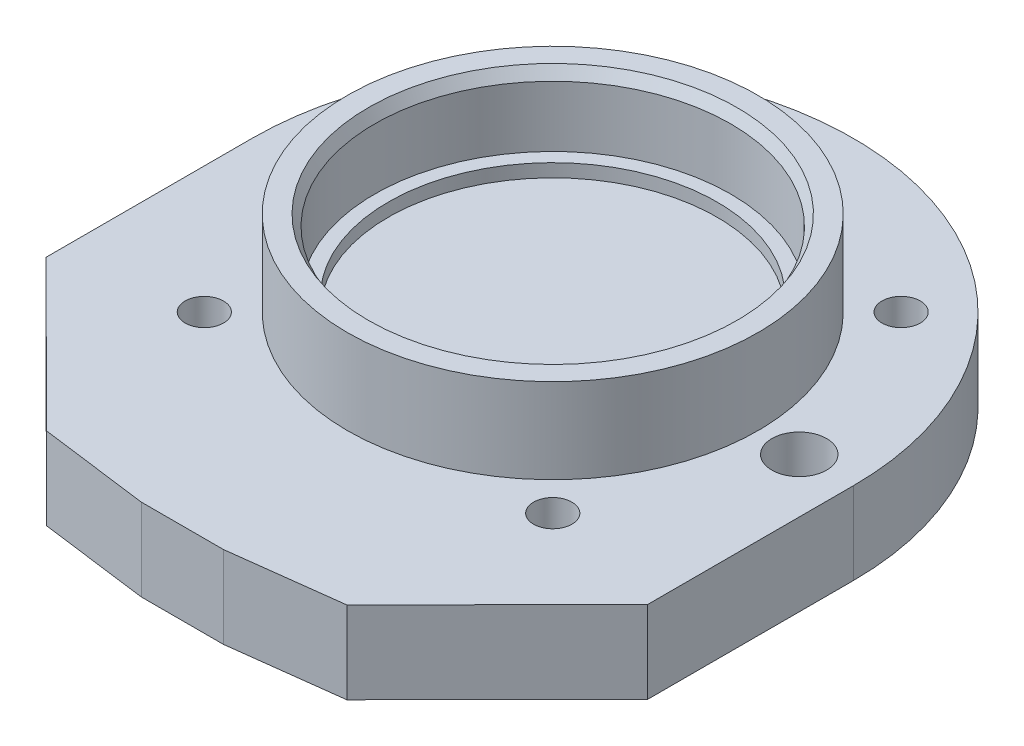
ISO-10303-21;
HEADER;
FILE_DESCRIPTION(('STEP AP214'),'2;1');
FILE_NAME('part.step','',(''),(''),'','','');
FILE_SCHEMA(('AUTOMOTIVE_DESIGN { 1 0 10303 214 1 1 1 1 }'));
ENDSEC;
DATA;
#1=APPLICATION_CONTEXT('core data for automotive mechanical design processes');
#2=APPLICATION_PROTOCOL_DEFINITION('international standard','automotive_design',2000,#1);
#3=PRODUCT_CONTEXT('',#1,'mechanical');
#4=PRODUCT('Part','Part','',(#3));
#5=PRODUCT_RELATED_PRODUCT_CATEGORY('part','',(#4));
#6=PRODUCT_DEFINITION_FORMATION('','',#4);
#7=PRODUCT_DEFINITION_CONTEXT('part definition',#1,'design');
#8=PRODUCT_DEFINITION('design','',#6,#7);
#9=PRODUCT_DEFINITION_SHAPE('','',#8);
#10=(LENGTH_UNIT() NAMED_UNIT(*) SI_UNIT(.MILLI.,.METRE.));
#11=(NAMED_UNIT(*) PLANE_ANGLE_UNIT() SI_UNIT($,.RADIAN.));
#12=(NAMED_UNIT(*) SI_UNIT($,.STERADIAN.) SOLID_ANGLE_UNIT());
#13=UNCERTAINTY_MEASURE_WITH_UNIT(LENGTH_MEASURE(1.E-05),#10,'distance_accuracy_value','');
#14=(GEOMETRIC_REPRESENTATION_CONTEXT(3) GLOBAL_UNCERTAINTY_ASSIGNED_CONTEXT((#13)) GLOBAL_UNIT_ASSIGNED_CONTEXT((#10,
#11,#12)) REPRESENTATION_CONTEXT('',''));
#15=CARTESIAN_POINT('',(0.,0.,0.));
#16=DIRECTION('',(0.,0.,1.));
#17=DIRECTION('',(1.,0.,0.));
#18=AXIS2_PLACEMENT_3D('',#15,#16,#17);
#19=CARTESIAN_POINT('',(0.,30.,0.));
#20=DIRECTION('',(0.,1.,0.));
#21=DIRECTION('',(0.,0.,1.));
#22=AXIS2_PLACEMENT_3D('',#19,#20,#21);
#23=PLANE('',#22);
#24=CARTESIAN_POINT('',(0.,30.,0.));
#25=DIRECTION('',(0.,1.,0.));
#26=DIRECTION('',(0.,0.,1.));
#27=AXIS2_PLACEMENT_3D('',#24,#25,#26);
#28=CIRCLE('',#27,60.);
#29=CARTESIAN_POINT('',(0.,30.,60.));
#30=VERTEX_POINT('',#29);
#31=EDGE_CURVE('E20',#30,#30,#28,.T.);
#32=ORIENTED_EDGE('',*,*,#31,.T.);
#33=EDGE_LOOP('',(#32));
#34=FACE_BOUND('',#33,.T.);
#35=ADVANCED_FACE('F17',(#34),#23,.T.);
#36=CARTESIAN_POINT('',(0.,34.8,0.));
#37=DIRECTION('',(0.,1.,0.));
#38=DIRECTION('',(0.,0.,1.));
#39=AXIS2_PLACEMENT_3D('',#36,#37,#38);
#40=CYLINDRICAL_SURFACE('',#39,60.);
#41=ORIENTED_EDGE('',*,*,#31,.F.);
#42=EDGE_LOOP('',(#41));
#43=FACE_BOUND('',#42,.T.);
#44=CARTESIAN_POINT('',(0.,34.8,0.));
#45=DIRECTION('',(0.,1.,0.));
#46=DIRECTION('',(0.,0.,1.));
#47=AXIS2_PLACEMENT_3D('',#44,#45,#46);
#48=CIRCLE('',#47,60.);
#49=CARTESIAN_POINT('',(0.,34.8,60.));
#50=VERTEX_POINT('',#49);
#51=EDGE_CURVE('E205',#50,#50,#48,.F.);
#52=ORIENTED_EDGE('',*,*,#51,.F.);
#53=EDGE_LOOP('',(#52));
#54=FACE_BOUND('',#53,.T.);
#55=ADVANCED_FACE('F213',(#43,#54),#40,.F.);
#56=CARTESIAN_POINT('',(0.,34.8,0.));
#57=DIRECTION('',(0.,1.,0.));
#58=DIRECTION('',(0.,0.,1.));
#59=AXIS2_PLACEMENT_3D('',#56,#57,#58);
#60=PLANE('',#59);
#61=ORIENTED_EDGE('',*,*,#51,.T.);
#62=EDGE_LOOP('',(#61));
#63=FACE_BOUND('',#62,.T.);
#64=CARTESIAN_POINT('',(0.,34.8,0.));
#65=DIRECTION('',(0.,1.,0.));
#66=DIRECTION('',(0.,0.,1.));
#67=AXIS2_PLACEMENT_3D('',#64,#65,#66);
#68=CIRCLE('',#67,65.);
#69=CARTESIAN_POINT('',(0.,34.8,65.));
#70=VERTEX_POINT('',#69);
#71=EDGE_CURVE('E203',#70,#70,#68,.T.);
#72=ORIENTED_EDGE('',*,*,#71,.T.);
#73=EDGE_LOOP('',(#72));
#74=FACE_BOUND('',#73,.T.);
#75=ADVANCED_FACE('F216',(#63,#74),#60,.T.);
#76=CARTESIAN_POINT('',(0.,61.,0.));
#77=DIRECTION('',(0.,1.,0.));
#78=DIRECTION('',(0.,0.,1.));
#79=AXIS2_PLACEMENT_3D('',#76,#77,#78);
#80=CYLINDRICAL_SURFACE('',#79,65.);
#81=ORIENTED_EDGE('',*,*,#71,.F.);
#82=EDGE_LOOP('',(#81));
#83=FACE_BOUND('',#82,.T.);
#84=CARTESIAN_POINT('',(4.90274487674E-13,56.999925434073,0.));
#85=DIRECTION('',(0.,1.,0.));
#86=DIRECTION('',(0.,0.,1.));
#87=AXIS2_PLACEMENT_3D('',#84,#85,#86);
#88=CIRCLE('',#87,65.);
#89=CARTESIAN_POINT('',(4.90274487674E-13,56.999925434073,64.9999999999999));
#90=VERTEX_POINT('',#89);
#91=EDGE_CURVE('E200',#90,#90,#88,.T.);
#92=ORIENTED_EDGE('',*,*,#91,.T.);
#93=EDGE_LOOP('',(#92));
#94=FACE_BOUND('',#93,.T.);
#95=ADVANCED_FACE('F222',(#83,#94),#80,.F.);
#96=CARTESIAN_POINT('',(4.90274487674E-13,60.9999806962001,0.));
#97=DIRECTION('',(0.,1.,0.));
#98=DIRECTION('',(0.,0.,1.));
#99=AXIS2_PLACEMENT_3D('',#96,#97,#98);
#100=CONICAL_SURFACE('',#99,67.3094345119396,0.523599062390001);
#101=ORIENTED_EDGE('',*,*,#91,.F.);
#102=EDGE_LOOP('',(#101));
#103=FACE_BOUND('',#102,.T.);
#104=CARTESIAN_POINT('',(4.90274487674E-13,61.,0.));
#105=DIRECTION('',(0.,1.,0.));
#106=DIRECTION('',(0.,0.,1.));
#107=AXIS2_PLACEMENT_3D('',#104,#105,#106);
#108=CIRCLE('',#107,67.309445657001);
#109=CARTESIAN_POINT('',(4.90274487674E-13,61.,67.3094456570009));
#110=VERTEX_POINT('',#109);
#111=EDGE_CURVE('E197',#110,#110,#108,.F.);
#112=ORIENTED_EDGE('',*,*,#111,.F.);
#113=EDGE_LOOP('',(#112));
#114=FACE_BOUND('',#113,.T.);
#115=ADVANCED_FACE('F322',(#103,#114),#100,.F.);
#116=CARTESIAN_POINT('',(0.,61.,0.));
#117=DIRECTION('',(0.,1.,0.));
#118=DIRECTION('',(0.,0.,1.));
#119=AXIS2_PLACEMENT_3D('',#116,#117,#118);
#120=PLANE('',#119);
#121=ORIENTED_EDGE('',*,*,#111,.T.);
#122=EDGE_LOOP('',(#121));
#123=FACE_BOUND('',#122,.T.);
#124=CARTESIAN_POINT('',(0.,61.,0.));
#125=DIRECTION('',(0.,1.,0.));
#126=DIRECTION('',(0.,0.,1.));
#127=AXIS2_PLACEMENT_3D('',#124,#125,#126);
#128=CIRCLE('',#127,75.);
#129=CARTESIAN_POINT('',(0.,61.,75.));
#130=VERTEX_POINT('',#129);
#131=EDGE_CURVE('E194',#130,#130,#128,.F.);
#132=ORIENTED_EDGE('',*,*,#131,.F.);
#133=EDGE_LOOP('',(#132));
#134=FACE_BOUND('',#133,.T.);
#135=ADVANCED_FACE('F318',(#123,#134),#120,.T.);
#136=CARTESIAN_POINT('',(0.,30.,0.));
#137=DIRECTION('',(0.,1.,0.));
#138=DIRECTION('',(0.,0.,1.));
#139=AXIS2_PLACEMENT_3D('',#136,#137,#138);
#140=CYLINDRICAL_SURFACE('',#139,75.);
#141=ORIENTED_EDGE('',*,*,#131,.T.);
#142=EDGE_LOOP('',(#141));
#143=FACE_BOUND('',#142,.T.);
#144=CARTESIAN_POINT('',(0.,30.,0.));
#145=DIRECTION('',(0.,1.,0.));
#146=DIRECTION('',(0.,0.,1.));
#147=AXIS2_PLACEMENT_3D('',#144,#145,#146);
#148=CIRCLE('',#147,75.);
#149=CARTESIAN_POINT('',(0.,30.,75.));
#150=VERTEX_POINT('',#149);
#151=EDGE_CURVE('E179',#150,#150,#148,.F.);
#152=ORIENTED_EDGE('',*,*,#151,.F.);
#153=EDGE_LOOP('',(#152));
#154=FACE_BOUND('',#153,.T.);
#155=ADVANCED_FACE('F314',(#143,#154),#140,.T.);
#156=CARTESIAN_POINT('',(-63.6,16.,-63.6));
#157=DIRECTION('',(0.,-1.,0.));
#158=DIRECTION('',(0.,0.,-1.));
#159=AXIS2_PLACEMENT_3D('',#156,#157,#158);
#160=CYLINDRICAL_SURFACE('',#159,7.);
#161=CARTESIAN_POINT('',(-63.6,16.,-63.6));
#162=DIRECTION('',(0.,-1.,0.));
#163=DIRECTION('',(0.,0.,-1.));
#164=AXIS2_PLACEMENT_3D('',#161,#162,#163);
#165=CIRCLE('',#164,7.);
#166=CARTESIAN_POINT('',(-63.6,16.,-70.6));
#167=VERTEX_POINT('',#166);
#168=EDGE_CURVE('E191',#167,#167,#165,.F.);
#169=ORIENTED_EDGE('',*,*,#168,.F.);
#170=EDGE_LOOP('',(#169));
#171=FACE_BOUND('',#170,.T.);
#172=CARTESIAN_POINT('',(-63.6,30.,-63.6));
#173=DIRECTION('',(0.,-1.,0.));
#174=DIRECTION('',(0.,0.,-1.));
#175=AXIS2_PLACEMENT_3D('',#172,#173,#174);
#176=CIRCLE('',#175,7.);
#177=CARTESIAN_POINT('',(-63.6,30.,-70.6));
#178=VERTEX_POINT('',#177);
#179=EDGE_CURVE('E176',#178,#178,#176,.T.);
#180=ORIENTED_EDGE('',*,*,#179,.F.);
#181=EDGE_LOOP('',(#180));
#182=FACE_BOUND('',#181,.T.);
#183=ADVANCED_FACE('F310',(#171,#182),#160,.F.);
#184=CARTESIAN_POINT('',(-63.6,16.,63.6));
#185=DIRECTION('',(0.,-1.,0.));
#186=DIRECTION('',(0.,0.,-1.));
#187=AXIS2_PLACEMENT_3D('',#184,#185,#186);
#188=CYLINDRICAL_SURFACE('',#187,7.);
#189=CARTESIAN_POINT('',(-63.6,16.,63.6));
#190=DIRECTION('',(0.,-1.,0.));
#191=DIRECTION('',(0.,0.,-1.));
#192=AXIS2_PLACEMENT_3D('',#189,#190,#191);
#193=CIRCLE('',#192,7.);
#194=CARTESIAN_POINT('',(-63.6,16.,56.6));
#195=VERTEX_POINT('',#194);
#196=EDGE_CURVE('E188',#195,#195,#193,.F.);
#197=ORIENTED_EDGE('',*,*,#196,.F.);
#198=EDGE_LOOP('',(#197));
#199=FACE_BOUND('',#198,.T.);
#200=CARTESIAN_POINT('',(-63.6,30.,63.6));
#201=DIRECTION('',(0.,-1.,0.));
#202=DIRECTION('',(0.,0.,-1.));
#203=AXIS2_PLACEMENT_3D('',#200,#201,#202);
#204=CIRCLE('',#203,7.);
#205=CARTESIAN_POINT('',(-63.6,30.,56.6));
#206=VERTEX_POINT('',#205);
#207=EDGE_CURVE('E173',#206,#206,#204,.T.);
#208=ORIENTED_EDGE('',*,*,#207,.F.);
#209=EDGE_LOOP('',(#208));
#210=FACE_BOUND('',#209,.T.);
#211=ADVANCED_FACE('F306',(#199,#210),#188,.F.);
#212=CARTESIAN_POINT('',(63.6,16.,63.6));
#213=DIRECTION('',(0.,-1.,0.));
#214=DIRECTION('',(0.,0.,-1.));
#215=AXIS2_PLACEMENT_3D('',#212,#213,#214);
#216=CYLINDRICAL_SURFACE('',#215,7.);
#217=CARTESIAN_POINT('',(63.6,16.,63.6));
#218=DIRECTION('',(0.,-1.,0.));
#219=DIRECTION('',(0.,0.,-1.));
#220=AXIS2_PLACEMENT_3D('',#217,#218,#219);
#221=CIRCLE('',#220,7.);
#222=CARTESIAN_POINT('',(63.6,16.,56.6));
#223=VERTEX_POINT('',#222);
#224=EDGE_CURVE('E185',#223,#223,#221,.F.);
#225=ORIENTED_EDGE('',*,*,#224,.F.);
#226=EDGE_LOOP('',(#225));
#227=FACE_BOUND('',#226,.T.);
#228=CARTESIAN_POINT('',(63.6,30.,63.6));
#229=DIRECTION('',(0.,-1.,0.));
#230=DIRECTION('',(0.,0.,-1.));
#231=AXIS2_PLACEMENT_3D('',#228,#229,#230);
#232=CIRCLE('',#231,7.);
#233=CARTESIAN_POINT('',(63.6,30.,56.6));
#234=VERTEX_POINT('',#233);
#235=EDGE_CURVE('E170',#234,#234,#232,.T.);
#236=ORIENTED_EDGE('',*,*,#235,.F.);
#237=EDGE_LOOP('',(#236));
#238=FACE_BOUND('',#237,.T.);
#239=ADVANCED_FACE('F302',(#227,#238),#216,.F.);
#240=CARTESIAN_POINT('',(63.6,16.,-63.6));
#241=DIRECTION('',(0.,-1.,0.));
#242=DIRECTION('',(0.,0.,-1.));
#243=AXIS2_PLACEMENT_3D('',#240,#241,#242);
#244=CYLINDRICAL_SURFACE('',#243,7.);
#245=CARTESIAN_POINT('',(63.6,16.,-63.6));
#246=DIRECTION('',(0.,-1.,0.));
#247=DIRECTION('',(0.,0.,-1.));
#248=AXIS2_PLACEMENT_3D('',#245,#246,#247);
#249=CIRCLE('',#248,7.);
#250=CARTESIAN_POINT('',(63.6,16.,-70.6));
#251=VERTEX_POINT('',#250);
#252=EDGE_CURVE('E182',#251,#251,#249,.F.);
#253=ORIENTED_EDGE('',*,*,#252,.F.);
#254=EDGE_LOOP('',(#253));
#255=FACE_BOUND('',#254,.T.);
#256=CARTESIAN_POINT('',(63.6,30.,-63.6));
#257=DIRECTION('',(0.,-1.,0.));
#258=DIRECTION('',(0.,0.,-1.));
#259=AXIS2_PLACEMENT_3D('',#256,#257,#258);
#260=CIRCLE('',#259,7.);
#261=CARTESIAN_POINT('',(63.6,30.,-70.6));
#262=VERTEX_POINT('',#261);
#263=EDGE_CURVE('E99',#262,#262,#260,.T.);
#264=ORIENTED_EDGE('',*,*,#263,.F.);
#265=EDGE_LOOP('',(#264));
#266=FACE_BOUND('',#265,.T.);
#267=ADVANCED_FACE('F298',(#255,#266),#244,.F.);
#268=CARTESIAN_POINT('',(0.,16.,0.));
#269=DIRECTION('',(0.,-1.,0.));
#270=DIRECTION('',(0.,0.,-1.));
#271=AXIS2_PLACEMENT_3D('',#268,#269,#270);
#272=PLANE('',#271);
#273=ORIENTED_EDGE('',*,*,#168,.T.);
#274=EDGE_LOOP('',(#273));
#275=FACE_BOUND('',#274,.T.);
#276=CARTESIAN_POINT('',(-63.6,16.,-63.6));
#277=DIRECTION('',(0.,-1.,0.));
#278=DIRECTION('',(0.,0.,-1.));
#279=AXIS2_PLACEMENT_3D('',#276,#277,#278);
#280=CIRCLE('',#279,10.);
#281=CARTESIAN_POINT('',(-63.6,16.,-73.6));
#282=VERTEX_POINT('',#281);
#283=EDGE_CURVE('E165',#282,#282,#280,.T.);
#284=ORIENTED_EDGE('',*,*,#283,.T.);
#285=EDGE_LOOP('',(#284));
#286=FACE_BOUND('',#285,.T.);
#287=ADVANCED_FACE('F294',(#275,#286),#272,.T.);
#288=CARTESIAN_POINT('',(0.,16.,0.));
#289=DIRECTION('',(0.,-1.,0.));
#290=DIRECTION('',(0.,0.,-1.));
#291=AXIS2_PLACEMENT_3D('',#288,#289,#290);
#292=PLANE('',#291);
#293=ORIENTED_EDGE('',*,*,#196,.T.);
#294=EDGE_LOOP('',(#293));
#295=FACE_BOUND('',#294,.T.);
#296=CARTESIAN_POINT('',(-63.6,16.,63.6));
#297=DIRECTION('',(0.,-1.,0.));
#298=DIRECTION('',(0.,0.,-1.));
#299=AXIS2_PLACEMENT_3D('',#296,#297,#298);
#300=CIRCLE('',#299,10.);
#301=CARTESIAN_POINT('',(-63.6,16.,53.6));
#302=VERTEX_POINT('',#301);
#303=EDGE_CURVE('E162',#302,#302,#300,.T.);
#304=ORIENTED_EDGE('',*,*,#303,.T.);
#305=EDGE_LOOP('',(#304));
#306=FACE_BOUND('',#305,.T.);
#307=ADVANCED_FACE('F290',(#295,#306),#292,.T.);
#308=CARTESIAN_POINT('',(0.,16.,0.));
#309=DIRECTION('',(0.,-1.,0.));
#310=DIRECTION('',(0.,0.,-1.));
#311=AXIS2_PLACEMENT_3D('',#308,#309,#310);
#312=PLANE('',#311);
#313=ORIENTED_EDGE('',*,*,#224,.T.);
#314=EDGE_LOOP('',(#313));
#315=FACE_BOUND('',#314,.T.);
#316=CARTESIAN_POINT('',(63.6,16.,63.6));
#317=DIRECTION('',(0.,-1.,0.));
#318=DIRECTION('',(0.,0.,-1.));
#319=AXIS2_PLACEMENT_3D('',#316,#317,#318);
#320=CIRCLE('',#319,10.);
#321=CARTESIAN_POINT('',(63.6,16.,53.6));
#322=VERTEX_POINT('',#321);
#323=EDGE_CURVE('E159',#322,#322,#320,.T.);
#324=ORIENTED_EDGE('',*,*,#323,.T.);
#325=EDGE_LOOP('',(#324));
#326=FACE_BOUND('',#325,.T.);
#327=ADVANCED_FACE('F286',(#315,#326),#312,.T.);
#328=CARTESIAN_POINT('',(0.,16.,0.));
#329=DIRECTION('',(0.,-1.,0.));
#330=DIRECTION('',(0.,0.,-1.));
#331=AXIS2_PLACEMENT_3D('',#328,#329,#330);
#332=PLANE('',#331);
#333=ORIENTED_EDGE('',*,*,#252,.T.);
#334=EDGE_LOOP('',(#333));
#335=FACE_BOUND('',#334,.T.);
#336=CARTESIAN_POINT('',(63.6,16.,-63.6));
#337=DIRECTION('',(0.,-1.,0.));
#338=DIRECTION('',(0.,0.,-1.));
#339=AXIS2_PLACEMENT_3D('',#336,#337,#338);
#340=CIRCLE('',#339,10.);
#341=CARTESIAN_POINT('',(63.6,16.,-73.6));
#342=VERTEX_POINT('',#341);
#343=EDGE_CURVE('E156',#342,#342,#340,.T.);
#344=ORIENTED_EDGE('',*,*,#343,.T.);
#345=EDGE_LOOP('',(#344));
#346=FACE_BOUND('',#345,.T.);
#347=ADVANCED_FACE('F282',(#335,#346),#332,.T.);
#348=CARTESIAN_POINT('',(0.,30.,0.));
#349=DIRECTION('',(0.,1.,0.));
#350=DIRECTION('',(0.,0.,1.));
#351=AXIS2_PLACEMENT_3D('',#348,#349,#350);
#352=PLANE('',#351);
#353=CARTESIAN_POINT('',(90.,30.,0.));
#354=DIRECTION('',(0.,-1.,0.));
#355=DIRECTION('',(0.,0.,-1.));
#356=AXIS2_PLACEMENT_3D('',#353,#354,#355);
#357=CIRCLE('',#356,10.);
#358=CARTESIAN_POINT('',(90.,30.,-10.));
#359=VERTEX_POINT('',#358);
#360=EDGE_CURVE('E153',#359,#359,#357,.T.);
#361=ORIENTED_EDGE('',*,*,#360,.T.);
#362=EDGE_LOOP('',(#361));
#363=FACE_BOUND('',#362,.T.);
#364=ORIENTED_EDGE('',*,*,#263,.T.);
#365=EDGE_LOOP('',(#364));
#366=FACE_BOUND('',#365,.T.);
#367=ORIENTED_EDGE('',*,*,#235,.T.);
#368=EDGE_LOOP('',(#367));
#369=FACE_BOUND('',#368,.T.);
#370=ORIENTED_EDGE('',*,*,#207,.T.);
#371=EDGE_LOOP('',(#370));
#372=FACE_BOUND('',#371,.T.);
#373=ORIENTED_EDGE('',*,*,#179,.T.);
#374=EDGE_LOOP('',(#373));
#375=FACE_BOUND('',#374,.T.);
#376=ORIENTED_EDGE('',*,*,#151,.T.);
#377=EDGE_LOOP('',(#376));
#378=FACE_BOUND('',#377,.T.);
#379=DIRECTION('',(0.,0.,-1.));
#380=VECTOR('',#379,1.);
#381=CARTESIAN_POINT('',(109.8,30.,75.2));
#382=LINE('',#381,#380);
#383=CARTESIAN_POINT('',(109.8,30.,0.));
#384=VERTEX_POINT('',#383);
#385=CARTESIAN_POINT('',(109.799999999995,30.,75.1999999999948));
#386=VERTEX_POINT('',#385);
#387=EDGE_CURVE('E95',#384,#386,#382,.F.);
#388=ORIENTED_EDGE('',*,*,#387,.F.);
#389=CARTESIAN_POINT('',(0.,30.,0.));
#390=DIRECTION('',(0.,1.,0.));
#391=DIRECTION('',(0.,0.,1.));
#392=AXIS2_PLACEMENT_3D('',#389,#390,#391);
#393=CIRCLE('',#392,109.8);
#394=CARTESIAN_POINT('',(-109.8,30.,0.));
#395=VERTEX_POINT('',#394);
#396=EDGE_CURVE('E89',#395,#384,#393,.F.);
#397=ORIENTED_EDGE('',*,*,#396,.F.);
#398=DIRECTION('',(0.,0.,1.));
#399=VECTOR('',#398,1.);
#400=CARTESIAN_POINT('',(-109.8,30.,0.));
#401=LINE('',#400,#399);
#402=CARTESIAN_POINT('',(-109.8,30.,75.2));
#403=VERTEX_POINT('',#402);
#404=EDGE_CURVE('E79',#403,#395,#401,.F.);
#405=ORIENTED_EDGE('',*,*,#404,.F.);
#406=DIRECTION('',(0.708393596513729,0.,0.70581761979873));
#407=VECTOR('',#406,1.);
#408=CARTESIAN_POINT('',(-109.8,30.,75.2));
#409=LINE('',#408,#407);
#410=CARTESIAN_POINT('',(-54.7999999999948,30.,129.999999999995));
#411=VERTEX_POINT('',#410);
#412=EDGE_CURVE('E104',#411,#403,#409,.F.);
#413=ORIENTED_EDGE('',*,*,#412,.F.);
#414=DIRECTION('',(0.991572603304275,0.,0.129552199427036));
#415=VECTOR('',#414,1.);
#416=CARTESIAN_POINT('',(-54.8,30.,130.));
#417=LINE('',#416,#415);
#418=CARTESIAN_POINT('',(-15.0000000000006,30.,135.200000000005));
#419=VERTEX_POINT('',#418);
#420=EDGE_CURVE('E131',#419,#411,#417,.F.);
#421=ORIENTED_EDGE('',*,*,#420,.F.);
#422=DIRECTION('',(1.,0.,0.));
#423=VECTOR('',#422,1.);
#424=CARTESIAN_POINT('',(-15.,30.,135.2));
#425=LINE('',#424,#423);
#426=CARTESIAN_POINT('',(15.,30.,135.2));
#427=VERTEX_POINT('',#426);
#428=EDGE_CURVE('E126',#427,#419,#425,.F.);
#429=ORIENTED_EDGE('',*,*,#428,.F.);
#430=DIRECTION('',(0.992277876713698,0.,-0.124034734588962));
#431=VECTOR('',#430,1.);
#432=CARTESIAN_POINT('',(15.,30.,135.2));
#433=LINE('',#432,#431);
#434=CARTESIAN_POINT('',(55.0000000000004,30.,130.200000000003));
#435=VERTEX_POINT('',#434);
#436=EDGE_CURVE('E121',#435,#427,#433,.F.);
#437=ORIENTED_EDGE('',*,*,#436,.F.);
#438=DIRECTION('',(0.70581761979873,0.,-0.708393596513729));
#439=VECTOR('',#438,1.);
#440=CARTESIAN_POINT('',(55.,30.,130.2));
#441=LINE('',#440,#439);
#442=EDGE_CURVE('E111',#386,#435,#441,.F.);
#443=ORIENTED_EDGE('',*,*,#442,.F.);
#444=EDGE_LOOP('',(#388,#397,#405,#413,#421,#429,#437,#443));
#445=FACE_BOUND('',#444,.T.);
#446=ADVANCED_FACE('F93',(#363,#366,#369,#372,#375,#378,#445),#352,.T.);
#447=CARTESIAN_POINT('',(0.,0.,0.));
#448=DIRECTION('',(0.,1.,0.));
#449=DIRECTION('',(0.,0.,1.));
#450=AXIS2_PLACEMENT_3D('',#447,#448,#449);
#451=CYLINDRICAL_SURFACE('',#450,109.8);
#452=DIRECTION('',(0.,1.,0.));
#453=VECTOR('',#452,1.);
#454=CARTESIAN_POINT('',(109.8,0.,0.));
#455=LINE('',#454,#453);
#456=CARTESIAN_POINT('',(109.8,0.,0.));
#457=VERTEX_POINT('',#456);
#458=EDGE_CURVE('E118',#457,#384,#455,.T.);
#459=ORIENTED_EDGE('',*,*,#458,.F.);
#460=CARTESIAN_POINT('',(0.,0.,0.));
#461=DIRECTION('',(0.,1.,0.));
#462=DIRECTION('',(0.,0.,1.));
#463=AXIS2_PLACEMENT_3D('',#460,#461,#462);
#464=CIRCLE('',#463,109.8);
#465=CARTESIAN_POINT('',(-109.8,0.,0.));
#466=VERTEX_POINT('',#465);
#467=EDGE_CURVE('E103',#457,#466,#464,.T.);
#468=ORIENTED_EDGE('',*,*,#467,.T.);
#469=DIRECTION('',(0.,1.,0.));
#470=VECTOR('',#469,1.);
#471=CARTESIAN_POINT('',(-109.8,0.,0.));
#472=LINE('',#471,#470);
#473=EDGE_CURVE('E84',#395,#466,#472,.F.);
#474=ORIENTED_EDGE('',*,*,#473,.F.);
#475=ORIENTED_EDGE('',*,*,#396,.T.);
#476=EDGE_LOOP('',(#459,#468,#474,#475));
#477=FACE_BOUND('',#476,.T.);
#478=ADVANCED_FACE('F102',(#477),#451,.T.);
#479=CARTESIAN_POINT('',(-109.8,0.,0.));
#480=DIRECTION('',(-1.,0.,0.));
#481=DIRECTION('',(0.,0.,1.));
#482=AXIS2_PLACEMENT_3D('',#479,#480,#481);
#483=PLANE('',#482);
#484=ORIENTED_EDGE('',*,*,#473,.T.);
#485=DIRECTION('',(0.,0.,1.));
#486=VECTOR('',#485,1.);
#487=CARTESIAN_POINT('',(-109.8,0.,0.));
#488=LINE('',#487,#486);
#489=CARTESIAN_POINT('',(-109.8,0.,75.2));
#490=VERTEX_POINT('',#489);
#491=EDGE_CURVE('E152',#466,#490,#488,.T.);
#492=ORIENTED_EDGE('',*,*,#491,.T.);
#493=DIRECTION('',(0.,1.,0.));
#494=VECTOR('',#493,1.);
#495=CARTESIAN_POINT('',(-109.8,0.,75.2));
#496=LINE('',#495,#494);
#497=EDGE_CURVE('E86',#403,#490,#496,.F.);
#498=ORIENTED_EDGE('',*,*,#497,.F.);
#499=ORIENTED_EDGE('',*,*,#404,.T.);
#500=EDGE_LOOP('',(#484,#492,#498,#499));
#501=FACE_BOUND('',#500,.T.);
#502=ADVANCED_FACE('F81',(#501),#483,.T.);
#503=CARTESIAN_POINT('',(-109.8,0.,75.2));
#504=DIRECTION('',(-0.70581761979873,0.,0.708393596513729));
#505=DIRECTION('',(0.708393596513729,0.,0.70581761979873));
#506=AXIS2_PLACEMENT_3D('',#503,#504,#505);
#507=PLANE('',#506);
#508=ORIENTED_EDGE('',*,*,#497,.T.);
#509=DIRECTION('',(0.708393596513527,0.,0.705817619798932));
#510=VECTOR('',#509,1.);
#511=CARTESIAN_POINT('',(-109.8,0.,75.2));
#512=LINE('',#511,#510);
#513=CARTESIAN_POINT('',(-54.8,0.,130.));
#514=VERTEX_POINT('',#513);
#515=EDGE_CURVE('E564',#490,#514,#512,.T.);
#516=ORIENTED_EDGE('',*,*,#515,.T.);
#517=DIRECTION('',(0.,1.,0.));
#518=VECTOR('',#517,1.);
#519=CARTESIAN_POINT('',(-54.8,0.,130.));
#520=LINE('',#519,#518);
#521=EDGE_CURVE('E128',#411,#514,#520,.F.);
#522=ORIENTED_EDGE('',*,*,#521,.F.);
#523=ORIENTED_EDGE('',*,*,#412,.T.);
#524=EDGE_LOOP('',(#508,#516,#522,#523));
#525=FACE_BOUND('',#524,.T.);
#526=ADVANCED_FACE('F271',(#525),#507,.T.);
#527=CARTESIAN_POINT('',(-54.8,0.,130.));
#528=DIRECTION('',(-0.129552199427036,0.,0.991572603304275));
#529=DIRECTION('',(0.991572603304275,0.,0.129552199427036));
#530=AXIS2_PLACEMENT_3D('',#527,#528,#529);
#531=PLANE('',#530);
#532=ORIENTED_EDGE('',*,*,#521,.T.);
#533=DIRECTION('',(0.99157260330432,0.,0.129552199426695));
#534=VECTOR('',#533,1.);
#535=CARTESIAN_POINT('',(-54.8,0.,130.));
#536=LINE('',#535,#534);
#537=CARTESIAN_POINT('',(-15.,0.,135.2));
#538=VERTEX_POINT('',#537);
#539=EDGE_CURVE('E546',#514,#538,#536,.T.);
#540=ORIENTED_EDGE('',*,*,#539,.T.);
#541=DIRECTION('',(0.,1.,0.));
#542=VECTOR('',#541,1.);
#543=CARTESIAN_POINT('',(-15.,0.,135.2));
#544=LINE('',#543,#542);
#545=EDGE_CURVE('E123',#419,#538,#544,.F.);
#546=ORIENTED_EDGE('',*,*,#545,.F.);
#547=ORIENTED_EDGE('',*,*,#420,.T.);
#548=EDGE_LOOP('',(#532,#540,#546,#547));
#549=FACE_BOUND('',#548,.T.);
#550=ADVANCED_FACE('F267',(#549),#531,.T.);
#551=CARTESIAN_POINT('',(-15.,0.,135.2));
#552=DIRECTION('',(0.,0.,1.));
#553=DIRECTION('',(1.,0.,0.));
#554=AXIS2_PLACEMENT_3D('',#551,#552,#553);
#555=PLANE('',#554);
#556=ORIENTED_EDGE('',*,*,#545,.T.);
#557=DIRECTION('',(1.,0.,0.));
#558=VECTOR('',#557,1.);
#559=CARTESIAN_POINT('',(0.,0.,135.2));
#560=LINE('',#559,#558);
#561=CARTESIAN_POINT('',(15.,0.,135.2));
#562=VERTEX_POINT('',#561);
#563=EDGE_CURVE('E544',#538,#562,#560,.T.);
#564=ORIENTED_EDGE('',*,*,#563,.T.);
#565=DIRECTION('',(0.,1.,0.));
#566=VECTOR('',#565,1.);
#567=CARTESIAN_POINT('',(15.,0.,135.2));
#568=LINE('',#567,#566);
#569=EDGE_CURVE('E114',#427,#562,#568,.F.);
#570=ORIENTED_EDGE('',*,*,#569,.F.);
#571=ORIENTED_EDGE('',*,*,#428,.T.);
#572=EDGE_LOOP('',(#556,#564,#570,#571));
#573=FACE_BOUND('',#572,.T.);
#574=ADVANCED_FACE('F263',(#573),#555,.T.);
#575=CARTESIAN_POINT('',(15.,0.,135.2));
#576=DIRECTION('',(0.124034734588962,0.,0.992277876713698));
#577=DIRECTION('',(0.992277876713698,0.,-0.124034734588962));
#578=AXIS2_PLACEMENT_3D('',#575,#576,#577);
#579=PLANE('',#578);
#580=ORIENTED_EDGE('',*,*,#569,.T.);
#581=DIRECTION('',(0.992277876713668,0.,-0.124034734589209));
#582=VECTOR('',#581,1.);
#583=CARTESIAN_POINT('',(15.,0.,135.2));
#584=LINE('',#583,#582);
#585=CARTESIAN_POINT('',(55.,0.,130.2));
#586=VERTEX_POINT('',#585);
#587=EDGE_CURVE('E539',#562,#586,#584,.T.);
#588=ORIENTED_EDGE('',*,*,#587,.T.);
#589=DIRECTION('',(0.,1.,0.));
#590=VECTOR('',#589,1.);
#591=CARTESIAN_POINT('',(55.,0.,130.2));
#592=LINE('',#591,#590);
#593=EDGE_CURVE('E113',#435,#586,#592,.F.);
#594=ORIENTED_EDGE('',*,*,#593,.F.);
#595=ORIENTED_EDGE('',*,*,#436,.T.);
#596=EDGE_LOOP('',(#580,#588,#594,#595));
#597=FACE_BOUND('',#596,.T.);
#598=ADVANCED_FACE('F259',(#597),#579,.T.);
#599=CARTESIAN_POINT('',(55.,0.,130.2));
#600=DIRECTION('',(0.708393596513729,0.,0.70581761979873));
#601=DIRECTION('',(0.70581761979873,0.,-0.708393596513729));
#602=AXIS2_PLACEMENT_3D('',#599,#600,#601);
#603=PLANE('',#602);
#604=ORIENTED_EDGE('',*,*,#593,.T.);
#605=DIRECTION('',(0.705817619798933,0.,-0.708393596513527));
#606=VECTOR('',#605,1.);
#607=CARTESIAN_POINT('',(55.,0.,130.2));
#608=LINE('',#607,#606);
#609=CARTESIAN_POINT('',(109.8,0.,75.2));
#610=VERTEX_POINT('',#609);
#611=EDGE_CURVE('E536',#586,#610,#608,.T.);
#612=ORIENTED_EDGE('',*,*,#611,.T.);
#613=DIRECTION('',(0.,1.,0.));
#614=VECTOR('',#613,1.);
#615=CARTESIAN_POINT('',(109.8,0.,75.2));
#616=LINE('',#615,#614);
#617=EDGE_CURVE('E35',#386,#610,#616,.F.);
#618=ORIENTED_EDGE('',*,*,#617,.F.);
#619=ORIENTED_EDGE('',*,*,#442,.T.);
#620=EDGE_LOOP('',(#604,#612,#618,#619));
#621=FACE_BOUND('',#620,.T.);
#622=ADVANCED_FACE('F256',(#621),#603,.T.);
#623=CARTESIAN_POINT('',(109.8,0.,75.2));
#624=DIRECTION('',(1.,0.,0.));
#625=DIRECTION('',(0.,0.,-1.));
#626=AXIS2_PLACEMENT_3D('',#623,#624,#625);
#627=PLANE('',#626);
#628=ORIENTED_EDGE('',*,*,#617,.T.);
#629=DIRECTION('',(0.,0.,1.));
#630=VECTOR('',#629,1.);
#631=CARTESIAN_POINT('',(109.8,0.,0.));
#632=LINE('',#631,#630);
#633=EDGE_CURVE('E150',#610,#457,#632,.F.);
#634=ORIENTED_EDGE('',*,*,#633,.T.);
#635=ORIENTED_EDGE('',*,*,#458,.T.);
#636=ORIENTED_EDGE('',*,*,#387,.T.);
#637=EDGE_LOOP('',(#628,#634,#635,#636));
#638=FACE_BOUND('',#637,.T.);
#639=ADVANCED_FACE('F252',(#638),#627,.T.);
#640=CARTESIAN_POINT('',(-63.6,0.,-63.6));
#641=DIRECTION('',(0.,-1.,0.));
#642=DIRECTION('',(0.,0.,-1.));
#643=AXIS2_PLACEMENT_3D('',#640,#641,#642);
#644=CYLINDRICAL_SURFACE('',#643,10.);
#645=ORIENTED_EDGE('',*,*,#283,.F.);
#646=EDGE_LOOP('',(#645));
#647=FACE_BOUND('',#646,.T.);
#648=CARTESIAN_POINT('',(-63.6,0.,-63.6));
#649=DIRECTION('',(0.,-1.,0.));
#650=DIRECTION('',(0.,0.,-1.));
#651=AXIS2_PLACEMENT_3D('',#648,#649,#650);
#652=CIRCLE('',#651,10.);
#653=CARTESIAN_POINT('',(-63.6,0.,-73.6));
#654=VERTEX_POINT('',#653);
#655=EDGE_CURVE('E147',#654,#654,#652,.T.);
#656=ORIENTED_EDGE('',*,*,#655,.T.);
#657=EDGE_LOOP('',(#656));
#658=FACE_BOUND('',#657,.T.);
#659=ADVANCED_FACE('F248',(#647,#658),#644,.F.);
#660=CARTESIAN_POINT('',(-63.6,0.,63.6));
#661=DIRECTION('',(0.,-1.,0.));
#662=DIRECTION('',(0.,0.,-1.));
#663=AXIS2_PLACEMENT_3D('',#660,#661,#662);
#664=CYLINDRICAL_SURFACE('',#663,10.);
#665=ORIENTED_EDGE('',*,*,#303,.F.);
#666=EDGE_LOOP('',(#665));
#667=FACE_BOUND('',#666,.T.);
#668=CARTESIAN_POINT('',(-63.6,0.,63.6));
#669=DIRECTION('',(0.,-1.,0.));
#670=DIRECTION('',(0.,0.,-1.));
#671=AXIS2_PLACEMENT_3D('',#668,#669,#670);
#672=CIRCLE('',#671,10.);
#673=CARTESIAN_POINT('',(-63.6,0.,53.6));
#674=VERTEX_POINT('',#673);
#675=EDGE_CURVE('E144',#674,#674,#672,.T.);
#676=ORIENTED_EDGE('',*,*,#675,.T.);
#677=EDGE_LOOP('',(#676));
#678=FACE_BOUND('',#677,.T.);
#679=ADVANCED_FACE('F244',(#667,#678),#664,.F.);
#680=CARTESIAN_POINT('',(63.6,0.,63.6));
#681=DIRECTION('',(0.,-1.,0.));
#682=DIRECTION('',(0.,0.,-1.));
#683=AXIS2_PLACEMENT_3D('',#680,#681,#682);
#684=CYLINDRICAL_SURFACE('',#683,10.);
#685=ORIENTED_EDGE('',*,*,#323,.F.);
#686=EDGE_LOOP('',(#685));
#687=FACE_BOUND('',#686,.T.);
#688=CARTESIAN_POINT('',(63.6,0.,63.6));
#689=DIRECTION('',(0.,-1.,0.));
#690=DIRECTION('',(0.,0.,-1.));
#691=AXIS2_PLACEMENT_3D('',#688,#689,#690);
#692=CIRCLE('',#691,10.);
#693=CARTESIAN_POINT('',(63.6,0.,53.6));
#694=VERTEX_POINT('',#693);
#695=EDGE_CURVE('E141',#694,#694,#692,.T.);
#696=ORIENTED_EDGE('',*,*,#695,.T.);
#697=EDGE_LOOP('',(#696));
#698=FACE_BOUND('',#697,.T.);
#699=ADVANCED_FACE('F240',(#687,#698),#684,.F.);
#700=CARTESIAN_POINT('',(63.6,0.,-63.6));
#701=DIRECTION('',(0.,-1.,0.));
#702=DIRECTION('',(0.,0.,-1.));
#703=AXIS2_PLACEMENT_3D('',#700,#701,#702);
#704=CYLINDRICAL_SURFACE('',#703,10.);
#705=ORIENTED_EDGE('',*,*,#343,.F.);
#706=EDGE_LOOP('',(#705));
#707=FACE_BOUND('',#706,.T.);
#708=CARTESIAN_POINT('',(63.6,0.,-63.6));
#709=DIRECTION('',(0.,-1.,0.));
#710=DIRECTION('',(0.,0.,-1.));
#711=AXIS2_PLACEMENT_3D('',#708,#709,#710);
#712=CIRCLE('',#711,10.);
#713=CARTESIAN_POINT('',(63.6,0.,-73.6));
#714=VERTEX_POINT('',#713);
#715=EDGE_CURVE('E26',#714,#714,#712,.T.);
#716=ORIENTED_EDGE('',*,*,#715,.T.);
#717=EDGE_LOOP('',(#716));
#718=FACE_BOUND('',#717,.T.);
#719=ADVANCED_FACE('F232',(#707,#718),#704,.F.);
#720=CARTESIAN_POINT('',(90.,0.,0.));
#721=DIRECTION('',(0.,-1.,0.));
#722=DIRECTION('',(0.,0.,-1.));
#723=AXIS2_PLACEMENT_3D('',#720,#721,#722);
#724=CYLINDRICAL_SURFACE('',#723,10.);
#725=ORIENTED_EDGE('',*,*,#360,.F.);
#726=EDGE_LOOP('',(#725));
#727=FACE_BOUND('',#726,.T.);
#728=CARTESIAN_POINT('',(90.,0.,0.));
#729=DIRECTION('',(0.,-1.,0.));
#730=DIRECTION('',(0.,0.,-1.));
#731=AXIS2_PLACEMENT_3D('',#728,#729,#730);
#732=CIRCLE('',#731,10.);
#733=CARTESIAN_POINT('',(90.,0.,-10.));
#734=VERTEX_POINT('',#733);
#735=EDGE_CURVE('E11',#734,#734,#732,.T.);
#736=ORIENTED_EDGE('',*,*,#735,.T.);
#737=EDGE_LOOP('',(#736));
#738=FACE_BOUND('',#737,.T.);
#739=ADVANCED_FACE('F226',(#727,#738),#724,.F.);
#740=CARTESIAN_POINT('',(0.,0.,0.));
#741=DIRECTION('',(0.,1.,0.));
#742=DIRECTION('',(0.,0.,1.));
#743=AXIS2_PLACEMENT_3D('',#740,#741,#742);
#744=PLANE('',#743);
#745=ORIENTED_EDGE('',*,*,#735,.F.);
#746=EDGE_LOOP('',(#745));
#747=FACE_BOUND('',#746,.T.);
#748=ORIENTED_EDGE('',*,*,#715,.F.);
#749=EDGE_LOOP('',(#748));
#750=FACE_BOUND('',#749,.T.);
#751=ORIENTED_EDGE('',*,*,#695,.F.);
#752=EDGE_LOOP('',(#751));
#753=FACE_BOUND('',#752,.T.);
#754=ORIENTED_EDGE('',*,*,#675,.F.);
#755=EDGE_LOOP('',(#754));
#756=FACE_BOUND('',#755,.T.);
#757=ORIENTED_EDGE('',*,*,#655,.F.);
#758=EDGE_LOOP('',(#757));
#759=FACE_BOUND('',#758,.T.);
#760=ORIENTED_EDGE('',*,*,#611,.F.);
#761=ORIENTED_EDGE('',*,*,#587,.F.);
#762=ORIENTED_EDGE('',*,*,#563,.F.);
#763=ORIENTED_EDGE('',*,*,#539,.F.);
#764=ORIENTED_EDGE('',*,*,#515,.F.);
#765=ORIENTED_EDGE('',*,*,#491,.F.);
#766=ORIENTED_EDGE('',*,*,#467,.F.);
#767=ORIENTED_EDGE('',*,*,#633,.F.);
#768=EDGE_LOOP('',(#760,#761,#762,#763,#764,#765,#766,#767));
#769=FACE_BOUND('',#768,.T.);
#770=ADVANCED_FACE('F224',(#747,#750,#753,#756,#759,#769),#744,.F.);
#771=CLOSED_SHELL('',(#35,#55,#75,#95,#115,#135,#155,#183,#211,#239,#267,#287,#307,#327,#347,
#446,#478,#502,#526,#550,#574,#598,#622,#639,#659,#679,#699,#719,#739,#770));
#772=MANIFOLD_SOLID_BREP('B1',#771);
#773=ADVANCED_BREP_SHAPE_REPRESENTATION('',(#18,#772),#14);
#774=SHAPE_DEFINITION_REPRESENTATION(#9,#773);
ENDSEC;
END-ISO-10303-21;
